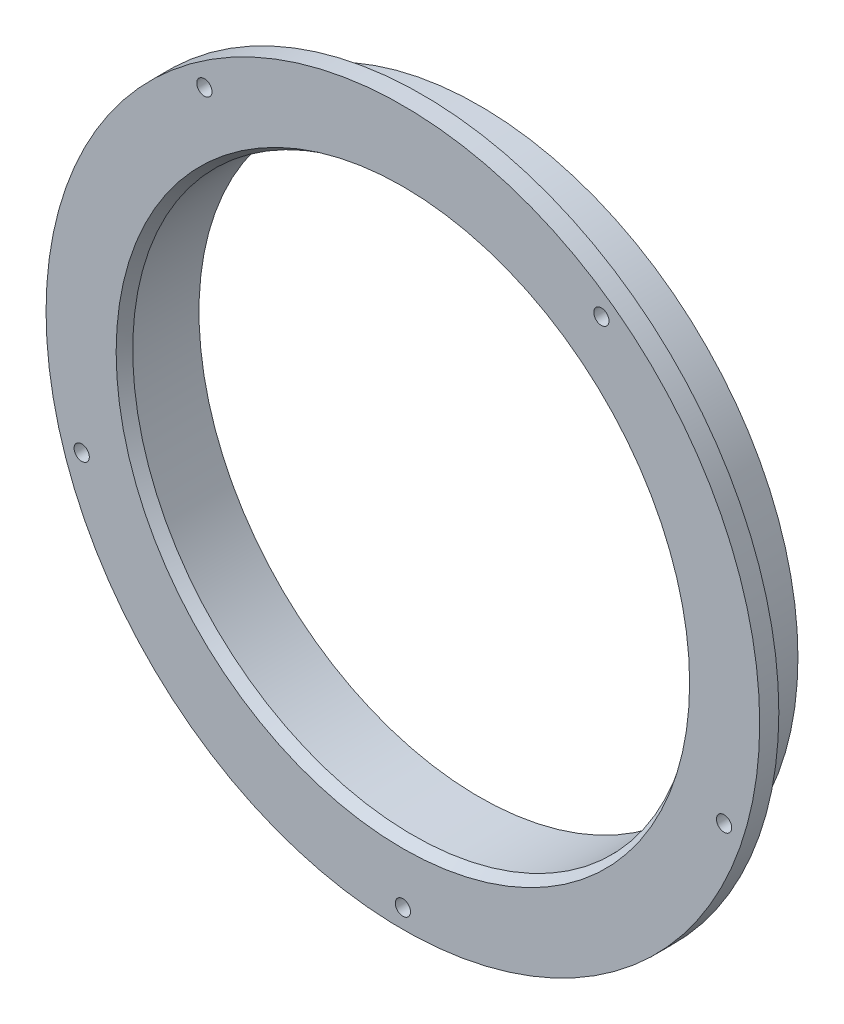
ISO-10303-21;
HEADER;
FILE_DESCRIPTION(('STEP AP214'),'2;1');
FILE_NAME('part.step','',(''),(''),'','','');
FILE_SCHEMA(('AUTOMOTIVE_DESIGN { 1 0 10303 214 1 1 1 1 }'));
ENDSEC;
DATA;
#1=APPLICATION_CONTEXT('core data for automotive mechanical design processes');
#2=APPLICATION_PROTOCOL_DEFINITION('international standard','automotive_design',2000,#1);
#3=PRODUCT_CONTEXT('',#1,'mechanical');
#4=PRODUCT('Part','Part','',(#3));
#5=PRODUCT_RELATED_PRODUCT_CATEGORY('part','',(#4));
#6=PRODUCT_DEFINITION_FORMATION('','',#4);
#7=PRODUCT_DEFINITION_CONTEXT('part definition',#1,'design');
#8=PRODUCT_DEFINITION('design','',#6,#7);
#9=PRODUCT_DEFINITION_SHAPE('','',#8);
#10=(LENGTH_UNIT() NAMED_UNIT(*) SI_UNIT(.MILLI.,.METRE.));
#11=(NAMED_UNIT(*) PLANE_ANGLE_UNIT() SI_UNIT($,.RADIAN.));
#12=(NAMED_UNIT(*) SI_UNIT($,.STERADIAN.) SOLID_ANGLE_UNIT());
#13=UNCERTAINTY_MEASURE_WITH_UNIT(LENGTH_MEASURE(1.E-05),#10,'distance_accuracy_value','');
#14=(GEOMETRIC_REPRESENTATION_CONTEXT(3) GLOBAL_UNCERTAINTY_ASSIGNED_CONTEXT((#13)) GLOBAL_UNIT_ASSIGNED_CONTEXT((#10,
#11,#12)) REPRESENTATION_CONTEXT('',''));
#15=CARTESIAN_POINT('',(0.,0.,0.));
#16=DIRECTION('',(0.,0.,1.));
#17=DIRECTION('',(1.,0.,0.));
#18=AXIS2_PLACEMENT_3D('',#15,#16,#17);
#19=CARTESIAN_POINT('',(0.,0.,0.));
#20=DIRECTION('',(0.,0.,1.));
#21=DIRECTION('',(1.,0.,0.));
#22=AXIS2_PLACEMENT_3D('',#19,#20,#21);
#23=PLANE('',#22);
#24=CARTESIAN_POINT('',(0.,-84.1375,0.));
#25=DIRECTION('',(0.,0.,1.));
#26=DIRECTION('',(1.,0.,0.));
#27=AXIS2_PLACEMENT_3D('',#24,#25,#26);
#28=CIRCLE('',#27,1.89864999999999);
#29=CARTESIAN_POINT('',(1.89864999999999,-84.1375,0.));
#30=VERTEX_POINT('',#29);
#31=EDGE_CURVE('E125',#30,#30,#28,.T.);
#32=ORIENTED_EDGE('',*,*,#31,.F.);
#33=EDGE_LOOP('',(#32));
#34=FACE_BOUND('',#33,.T.);
#35=CARTESIAN_POINT('',(-80.0195176397835,-25.9999173642219,0.));
#36=DIRECTION('',(0.,0.,1.));
#37=DIRECTION('',(1.,0.,0.));
#38=AXIS2_PLACEMENT_3D('',#35,#36,#37);
#39=CIRCLE('',#38,1.89864999999999);
#40=CARTESIAN_POINT('',(-78.1208676397836,-25.9999173642219,0.));
#41=VERTEX_POINT('',#40);
#42=EDGE_CURVE('E117',#41,#41,#39,.T.);
#43=ORIENTED_EDGE('',*,*,#42,.F.);
#44=EDGE_LOOP('',(#43));
#45=FACE_BOUND('',#44,.T.);
#46=CARTESIAN_POINT('',(-49.4547816647576,68.0686673642224,0.));
#47=DIRECTION('',(0.,0.,1.));
#48=DIRECTION('',(1.,0.,0.));
#49=AXIS2_PLACEMENT_3D('',#46,#47,#48);
#50=CIRCLE('',#49,1.89864999999999);
#51=CARTESIAN_POINT('',(-47.5561316647576,68.0686673642224,0.));
#52=VERTEX_POINT('',#51);
#53=EDGE_CURVE('E109',#52,#52,#50,.T.);
#54=ORIENTED_EDGE('',*,*,#53,.F.);
#55=EDGE_LOOP('',(#54));
#56=FACE_BOUND('',#55,.T.);
#57=CARTESIAN_POINT('',(80.0195176397835,-25.9999173642219,0.));
#58=DIRECTION('',(0.,0.,1.));
#59=DIRECTION('',(1.,0.,0.));
#60=AXIS2_PLACEMENT_3D('',#57,#58,#59);
#61=CIRCLE('',#60,1.89864999999999);
#62=CARTESIAN_POINT('',(81.9181676397835,-25.9999173642219,0.));
#63=VERTEX_POINT('',#62);
#64=EDGE_CURVE('E102',#63,#63,#61,.T.);
#65=ORIENTED_EDGE('',*,*,#64,.F.);
#66=EDGE_LOOP('',(#65));
#67=FACE_BOUND('',#66,.T.);
#68=CARTESIAN_POINT('',(49.4547816647576,68.0686673642224,0.));
#69=DIRECTION('',(0.,0.,1.));
#70=DIRECTION('',(1.,0.,0.));
#71=AXIS2_PLACEMENT_3D('',#68,#69,#70);
#72=CIRCLE('',#71,1.89864999999999);
#73=CARTESIAN_POINT('',(51.3534316647576,68.0686673642224,0.));
#74=VERTEX_POINT('',#73);
#75=EDGE_CURVE('E95',#74,#74,#72,.T.);
#76=ORIENTED_EDGE('',*,*,#75,.F.);
#77=EDGE_LOOP('',(#76));
#78=FACE_BOUND('',#77,.T.);
#79=CARTESIAN_POINT('',(0.,0.,0.));
#80=DIRECTION('',(0.,0.,1.));
#81=DIRECTION('',(1.,0.,0.));
#82=AXIS2_PLACEMENT_3D('',#79,#80,#81);
#83=CIRCLE('',#82,88.9);
#84=CARTESIAN_POINT('',(88.9,0.,0.));
#85=VERTEX_POINT('',#84);
#86=EDGE_CURVE('E91',#85,#85,#83,.T.);
#87=ORIENTED_EDGE('',*,*,#86,.T.);
#88=EDGE_LOOP('',(#87));
#89=FACE_BOUND('',#88,.T.);
#90=CARTESIAN_POINT('',(0.,0.,0.));
#91=DIRECTION('',(0.,0.,1.));
#92=DIRECTION('',(1.,0.,0.));
#93=AXIS2_PLACEMENT_3D('',#90,#91,#92);
#94=CIRCLE('',#93,71.4375);
#95=CARTESIAN_POINT('',(71.4375,0.,0.));
#96=VERTEX_POINT('',#95);
#97=EDGE_CURVE('E10',#96,#96,#94,.T.);
#98=ORIENTED_EDGE('',*,*,#97,.F.);
#99=EDGE_LOOP('',(#98));
#100=FACE_BOUND('',#99,.T.);
#101=ADVANCED_FACE('F42',(#34,#45,#56,#67,#78,#89,#100),#23,.T.);
#102=CARTESIAN_POINT('',(0.,0.,0.));
#103=DIRECTION('',(0.,0.,1.));
#104=DIRECTION('',(1.,0.,0.));
#105=AXIS2_PLACEMENT_3D('',#102,#103,#104);
#106=CONICAL_SURFACE('',#105,71.4375,0.558599315343566);
#107=CARTESIAN_POINT('',(0.,0.,-2.54000000000001));
#108=DIRECTION('',(0.,0.,1.));
#109=DIRECTION('',(1.,0.,0.));
#110=AXIS2_PLACEMENT_3D('',#107,#108,#109);
#111=CIRCLE('',#110,69.85);
#112=CARTESIAN_POINT('',(69.85,0.,-2.54000000000001));
#113=VERTEX_POINT('',#112);
#114=EDGE_CURVE('E49',#113,#113,#111,.T.);
#115=ORIENTED_EDGE('',*,*,#114,.F.);
#116=EDGE_LOOP('',(#115));
#117=FACE_BOUND('',#116,.T.);
#118=ORIENTED_EDGE('',*,*,#97,.T.);
#119=EDGE_LOOP('',(#118));
#120=FACE_BOUND('',#119,.T.);
#121=ADVANCED_FACE('F162',(#117,#120),#106,.F.);
#122=CARTESIAN_POINT('',(0.,0.,0.));
#123=DIRECTION('',(0.,0.,1.));
#124=DIRECTION('',(1.,0.,0.));
#125=AXIS2_PLACEMENT_3D('',#122,#123,#124);
#126=CYLINDRICAL_SURFACE('',#125,69.85);
#127=CARTESIAN_POINT('',(0.,0.,-19.05));
#128=DIRECTION('',(0.,0.,1.));
#129=DIRECTION('',(1.,0.,0.));
#130=AXIS2_PLACEMENT_3D('',#127,#128,#129);
#131=CIRCLE('',#130,69.85);
#132=CARTESIAN_POINT('',(69.85,0.,-19.05));
#133=VERTEX_POINT('',#132);
#134=EDGE_CURVE('E56',#133,#133,#131,.T.);
#135=ORIENTED_EDGE('',*,*,#134,.F.);
#136=EDGE_LOOP('',(#135));
#137=FACE_BOUND('',#136,.T.);
#138=ORIENTED_EDGE('',*,*,#114,.T.);
#139=EDGE_LOOP('',(#138));
#140=FACE_BOUND('',#139,.T.);
#141=ADVANCED_FACE('F167',(#137,#140),#126,.F.);
#142=CARTESIAN_POINT('',(0.,0.,-19.05));
#143=DIRECTION('',(0.,0.,-1.));
#144=DIRECTION('',(-1.,0.,0.));
#145=AXIS2_PLACEMENT_3D('',#142,#143,#144);
#146=PLANE('',#145);
#147=ORIENTED_EDGE('',*,*,#134,.T.);
#148=EDGE_LOOP('',(#147));
#149=FACE_BOUND('',#148,.T.);
#150=CARTESIAN_POINT('',(0.,0.,-19.05));
#151=DIRECTION('',(0.,0.,1.));
#152=DIRECTION('',(1.,0.,0.));
#153=AXIS2_PLACEMENT_3D('',#150,#151,#152);
#154=CIRCLE('',#153,72.9615);
#155=CARTESIAN_POINT('',(72.9615,0.,-19.05));
#156=VERTEX_POINT('',#155);
#157=EDGE_CURVE('E63',#156,#156,#154,.T.);
#158=ORIENTED_EDGE('',*,*,#157,.F.);
#159=EDGE_LOOP('',(#158));
#160=FACE_BOUND('',#159,.T.);
#161=ADVANCED_FACE('F209',(#149,#160),#146,.T.);
#162=CARTESIAN_POINT('',(0.,0.,0.));
#163=DIRECTION('',(0.,0.,1.));
#164=DIRECTION('',(1.,0.,0.));
#165=AXIS2_PLACEMENT_3D('',#162,#163,#164);
#166=CYLINDRICAL_SURFACE('',#165,72.9615);
#167=ORIENTED_EDGE('',*,*,#157,.T.);
#168=EDGE_LOOP('',(#167));
#169=FACE_BOUND('',#168,.T.);
#170=CARTESIAN_POINT('',(0.,0.,-6.35));
#171=DIRECTION('',(0.,0.,1.));
#172=DIRECTION('',(1.,0.,0.));
#173=AXIS2_PLACEMENT_3D('',#170,#171,#172);
#174=CIRCLE('',#173,72.9615);
#175=CARTESIAN_POINT('',(72.9615,0.,-6.35));
#176=VERTEX_POINT('',#175);
#177=EDGE_CURVE('E69',#176,#176,#174,.T.);
#178=ORIENTED_EDGE('',*,*,#177,.F.);
#179=EDGE_LOOP('',(#178));
#180=FACE_BOUND('',#179,.T.);
#181=ADVANCED_FACE('F205',(#169,#180),#166,.T.);
#182=CARTESIAN_POINT('',(0.,0.,-6.35));
#183=DIRECTION('',(0.,0.,-1.));
#184=DIRECTION('',(-1.,0.,0.));
#185=AXIS2_PLACEMENT_3D('',#182,#183,#184);
#186=PLANE('',#185);
#187=ORIENTED_EDGE('',*,*,#177,.T.);
#188=EDGE_LOOP('',(#187));
#189=FACE_BOUND('',#188,.T.);
#190=CARTESIAN_POINT('',(0.,0.,-6.35));
#191=DIRECTION('',(0.,0.,1.));
#192=DIRECTION('',(1.,0.,0.));
#193=AXIS2_PLACEMENT_3D('',#190,#191,#192);
#194=CIRCLE('',#193,76.2635);
#195=CARTESIAN_POINT('',(76.2635,0.,-6.35));
#196=VERTEX_POINT('',#195);
#197=EDGE_CURVE('E72',#196,#196,#194,.T.);
#198=ORIENTED_EDGE('',*,*,#197,.F.);
#199=EDGE_LOOP('',(#198));
#200=FACE_BOUND('',#199,.T.);
#201=ADVANCED_FACE('F201',(#189,#200),#186,.T.);
#202=CARTESIAN_POINT('',(0.,0.,0.));
#203=DIRECTION('',(0.,0.,1.));
#204=DIRECTION('',(1.,0.,0.));
#205=AXIS2_PLACEMENT_3D('',#202,#203,#204);
#206=CYLINDRICAL_SURFACE('',#205,76.2635);
#207=ORIENTED_EDGE('',*,*,#197,.T.);
#208=EDGE_LOOP('',(#207));
#209=FACE_BOUND('',#208,.T.);
#210=CARTESIAN_POINT('',(0.,0.,-19.05));
#211=DIRECTION('',(0.,0.,1.));
#212=DIRECTION('',(1.,0.,0.));
#213=AXIS2_PLACEMENT_3D('',#210,#211,#212);
#214=CIRCLE('',#213,76.2635);
#215=CARTESIAN_POINT('',(76.2635,0.,-19.05));
#216=VERTEX_POINT('',#215);
#217=EDGE_CURVE('E76',#216,#216,#214,.T.);
#218=ORIENTED_EDGE('',*,*,#217,.F.);
#219=EDGE_LOOP('',(#218));
#220=FACE_BOUND('',#219,.T.);
#221=ADVANCED_FACE('F197',(#209,#220),#206,.F.);
#222=CARTESIAN_POINT('',(0.,0.,-19.05));
#223=DIRECTION('',(0.,0.,-1.));
#224=DIRECTION('',(-1.,0.,0.));
#225=AXIS2_PLACEMENT_3D('',#222,#223,#224);
#226=PLANE('',#225);
#227=ORIENTED_EDGE('',*,*,#217,.T.);
#228=EDGE_LOOP('',(#227));
#229=FACE_BOUND('',#228,.T.);
#230=CARTESIAN_POINT('',(0.,0.,-19.05));
#231=DIRECTION('',(0.,0.,1.));
#232=DIRECTION('',(1.,0.,0.));
#233=AXIS2_PLACEMENT_3D('',#230,#231,#232);
#234=CIRCLE('',#233,79.375);
#235=CARTESIAN_POINT('',(79.375,0.,-19.05));
#236=VERTEX_POINT('',#235);
#237=EDGE_CURVE('E79',#236,#236,#234,.T.);
#238=ORIENTED_EDGE('',*,*,#237,.F.);
#239=EDGE_LOOP('',(#238));
#240=FACE_BOUND('',#239,.T.);
#241=ADVANCED_FACE('F193',(#229,#240),#226,.T.);
#242=CARTESIAN_POINT('',(0.,0.,0.));
#243=DIRECTION('',(0.,0.,1.));
#244=DIRECTION('',(1.,0.,0.));
#245=AXIS2_PLACEMENT_3D('',#242,#243,#244);
#246=CYLINDRICAL_SURFACE('',#245,79.375);
#247=ORIENTED_EDGE('',*,*,#237,.T.);
#248=EDGE_LOOP('',(#247));
#249=FACE_BOUND('',#248,.T.);
#250=CARTESIAN_POINT('',(0.,0.,-4.7625));
#251=DIRECTION('',(0.,0.,1.));
#252=DIRECTION('',(1.,0.,0.));
#253=AXIS2_PLACEMENT_3D('',#250,#251,#252);
#254=CIRCLE('',#253,79.375);
#255=CARTESIAN_POINT('',(79.375,0.,-4.7625));
#256=VERTEX_POINT('',#255);
#257=EDGE_CURVE('E83',#256,#256,#254,.T.);
#258=ORIENTED_EDGE('',*,*,#257,.F.);
#259=EDGE_LOOP('',(#258));
#260=FACE_BOUND('',#259,.T.);
#261=ADVANCED_FACE('F140',(#249,#260),#246,.T.);
#262=CARTESIAN_POINT('',(0.,0.,-4.7625));
#263=DIRECTION('',(0.,0.,-1.));
#264=DIRECTION('',(-1.,0.,0.));
#265=AXIS2_PLACEMENT_3D('',#262,#263,#264);
#266=PLANE('',#265);
#267=CARTESIAN_POINT('',(0.,-84.1375,-4.7625));
#268=DIRECTION('',(0.,0.,-1.));
#269=DIRECTION('',(-1.,0.,0.));
#270=AXIS2_PLACEMENT_3D('',#267,#268,#269);
#271=CIRCLE('',#270,1.89864999999999);
#272=CARTESIAN_POINT('',(-1.89864999999999,-84.1375,-4.7625));
#273=VERTEX_POINT('',#272);
#274=EDGE_CURVE('E129',#273,#273,#271,.T.);
#275=ORIENTED_EDGE('',*,*,#274,.F.);
#276=EDGE_LOOP('',(#275));
#277=FACE_BOUND('',#276,.T.);
#278=CARTESIAN_POINT('',(-80.0195176397835,-25.9999173642219,-4.7625));
#279=DIRECTION('',(0.,0.,-1.));
#280=DIRECTION('',(-1.,0.,0.));
#281=AXIS2_PLACEMENT_3D('',#278,#279,#280);
#282=CIRCLE('',#281,1.89864999999999);
#283=CARTESIAN_POINT('',(-81.9181676397835,-25.9999173642219,-4.7625));
#284=VERTEX_POINT('',#283);
#285=EDGE_CURVE('E121',#284,#284,#282,.T.);
#286=ORIENTED_EDGE('',*,*,#285,.F.);
#287=EDGE_LOOP('',(#286));
#288=FACE_BOUND('',#287,.T.);
#289=CARTESIAN_POINT('',(-49.4547816647576,68.0686673642224,-4.7625));
#290=DIRECTION('',(0.,0.,-1.));
#291=DIRECTION('',(-1.,0.,0.));
#292=AXIS2_PLACEMENT_3D('',#289,#290,#291);
#293=CIRCLE('',#292,1.89864999999999);
#294=CARTESIAN_POINT('',(-51.3534316647576,68.0686673642224,-4.7625));
#295=VERTEX_POINT('',#294);
#296=EDGE_CURVE('E113',#295,#295,#293,.T.);
#297=ORIENTED_EDGE('',*,*,#296,.F.);
#298=EDGE_LOOP('',(#297));
#299=FACE_BOUND('',#298,.T.);
#300=CARTESIAN_POINT('',(80.0195176397835,-25.9999173642219,-4.7625));
#301=DIRECTION('',(0.,0.,-1.));
#302=DIRECTION('',(-1.,0.,0.));
#303=AXIS2_PLACEMENT_3D('',#300,#301,#302);
#304=CIRCLE('',#303,1.89864999999999);
#305=CARTESIAN_POINT('',(78.1208676397836,-25.9999173642219,-4.7625));
#306=VERTEX_POINT('',#305);
#307=EDGE_CURVE('E106',#306,#306,#304,.T.);
#308=ORIENTED_EDGE('',*,*,#307,.F.);
#309=EDGE_LOOP('',(#308));
#310=FACE_BOUND('',#309,.T.);
#311=CARTESIAN_POINT('',(49.4547816647576,68.0686673642224,-4.7625));
#312=DIRECTION('',(0.,0.,-1.));
#313=DIRECTION('',(-1.,0.,0.));
#314=AXIS2_PLACEMENT_3D('',#311,#312,#313);
#315=CIRCLE('',#314,1.89864999999999);
#316=CARTESIAN_POINT('',(47.5561316647576,68.0686673642224,-4.7625));
#317=VERTEX_POINT('',#316);
#318=EDGE_CURVE('E99',#317,#317,#315,.T.);
#319=ORIENTED_EDGE('',*,*,#318,.F.);
#320=EDGE_LOOP('',(#319));
#321=FACE_BOUND('',#320,.T.);
#322=ORIENTED_EDGE('',*,*,#257,.T.);
#323=EDGE_LOOP('',(#322));
#324=FACE_BOUND('',#323,.T.);
#325=CARTESIAN_POINT('',(0.,0.,-4.7625));
#326=DIRECTION('',(0.,0.,1.));
#327=DIRECTION('',(1.,0.,0.));
#328=AXIS2_PLACEMENT_3D('',#325,#326,#327);
#329=CIRCLE('',#328,88.9);
#330=CARTESIAN_POINT('',(88.9,0.,-4.7625));
#331=VERTEX_POINT('',#330);
#332=EDGE_CURVE('E87',#331,#331,#329,.T.);
#333=ORIENTED_EDGE('',*,*,#332,.F.);
#334=EDGE_LOOP('',(#333));
#335=FACE_BOUND('',#334,.T.);
#336=ADVANCED_FACE('F136',(#277,#288,#299,#310,#321,#324,#335),#266,.T.);
#337=CARTESIAN_POINT('',(0.,0.,0.));
#338=DIRECTION('',(0.,0.,1.));
#339=DIRECTION('',(1.,0.,0.));
#340=AXIS2_PLACEMENT_3D('',#337,#338,#339);
#341=CYLINDRICAL_SURFACE('',#340,88.9);
#342=ORIENTED_EDGE('',*,*,#332,.T.);
#343=EDGE_LOOP('',(#342));
#344=FACE_BOUND('',#343,.T.);
#345=ORIENTED_EDGE('',*,*,#86,.F.);
#346=EDGE_LOOP('',(#345));
#347=FACE_BOUND('',#346,.T.);
#348=ADVANCED_FACE('F139',(#344,#347),#341,.T.);
#349=CARTESIAN_POINT('',(49.4547816647576,68.0686673642224,-4.7625));
#350=DIRECTION('',(0.,0.,-1.));
#351=DIRECTION('',(-1.,0.,0.));
#352=AXIS2_PLACEMENT_3D('',#349,#350,#351);
#353=CYLINDRICAL_SURFACE('',#352,1.89864999999999);
#354=ORIENTED_EDGE('',*,*,#75,.T.);
#355=EDGE_LOOP('',(#354));
#356=FACE_BOUND('',#355,.T.);
#357=ORIENTED_EDGE('',*,*,#318,.T.);
#358=EDGE_LOOP('',(#357));
#359=FACE_BOUND('',#358,.T.);
#360=ADVANCED_FACE('F156',(#356,#359),#353,.F.);
#361=CARTESIAN_POINT('',(80.0195176397835,-25.9999173642219,-4.7625));
#362=DIRECTION('',(0.,0.,-1.));
#363=DIRECTION('',(-1.,0.,0.));
#364=AXIS2_PLACEMENT_3D('',#361,#362,#363);
#365=CYLINDRICAL_SURFACE('',#364,1.89864999999999);
#366=ORIENTED_EDGE('',*,*,#64,.T.);
#367=EDGE_LOOP('',(#366));
#368=FACE_BOUND('',#367,.T.);
#369=ORIENTED_EDGE('',*,*,#307,.T.);
#370=EDGE_LOOP('',(#369));
#371=FACE_BOUND('',#370,.T.);
#372=ADVANCED_FACE('F181',(#368,#371),#365,.F.);
#373=CARTESIAN_POINT('',(-49.4547816647576,68.0686673642224,-4.7625));
#374=DIRECTION('',(0.,0.,-1.));
#375=DIRECTION('',(-1.,0.,0.));
#376=AXIS2_PLACEMENT_3D('',#373,#374,#375);
#377=CYLINDRICAL_SURFACE('',#376,1.89864999999999);
#378=ORIENTED_EDGE('',*,*,#53,.T.);
#379=EDGE_LOOP('',(#378));
#380=FACE_BOUND('',#379,.T.);
#381=ORIENTED_EDGE('',*,*,#296,.T.);
#382=EDGE_LOOP('',(#381));
#383=FACE_BOUND('',#382,.T.);
#384=ADVANCED_FACE('F186',(#380,#383),#377,.F.);
#385=CARTESIAN_POINT('',(-80.0195176397835,-25.9999173642219,-4.7625));
#386=DIRECTION('',(0.,0.,-1.));
#387=DIRECTION('',(-1.,0.,0.));
#388=AXIS2_PLACEMENT_3D('',#385,#386,#387);
#389=CYLINDRICAL_SURFACE('',#388,1.89864999999999);
#390=ORIENTED_EDGE('',*,*,#42,.T.);
#391=EDGE_LOOP('',(#390));
#392=FACE_BOUND('',#391,.T.);
#393=ORIENTED_EDGE('',*,*,#285,.T.);
#394=EDGE_LOOP('',(#393));
#395=FACE_BOUND('',#394,.T.);
#396=ADVANCED_FACE('F272',(#392,#395),#389,.F.);
#397=CARTESIAN_POINT('',(0.,-84.1375,-4.7625));
#398=DIRECTION('',(0.,0.,-1.));
#399=DIRECTION('',(-1.,0.,0.));
#400=AXIS2_PLACEMENT_3D('',#397,#398,#399);
#401=CYLINDRICAL_SURFACE('',#400,1.89864999999999);
#402=ORIENTED_EDGE('',*,*,#31,.T.);
#403=EDGE_LOOP('',(#402));
#404=FACE_BOUND('',#403,.T.);
#405=ORIENTED_EDGE('',*,*,#274,.T.);
#406=EDGE_LOOP('',(#405));
#407=FACE_BOUND('',#406,.T.);
#408=ADVANCED_FACE('F134',(#404,#407),#401,.F.);
#409=CLOSED_SHELL('',(#101,#121,#141,#161,#181,#201,#221,#241,#261,#336,#348,#360,#372,#384,
#396,#408));
#410=MANIFOLD_SOLID_BREP('B2',#409);
#411=ADVANCED_BREP_SHAPE_REPRESENTATION('',(#18,#410),#14);
#412=SHAPE_DEFINITION_REPRESENTATION(#9,#411);
ENDSEC;
END-ISO-10303-21;
